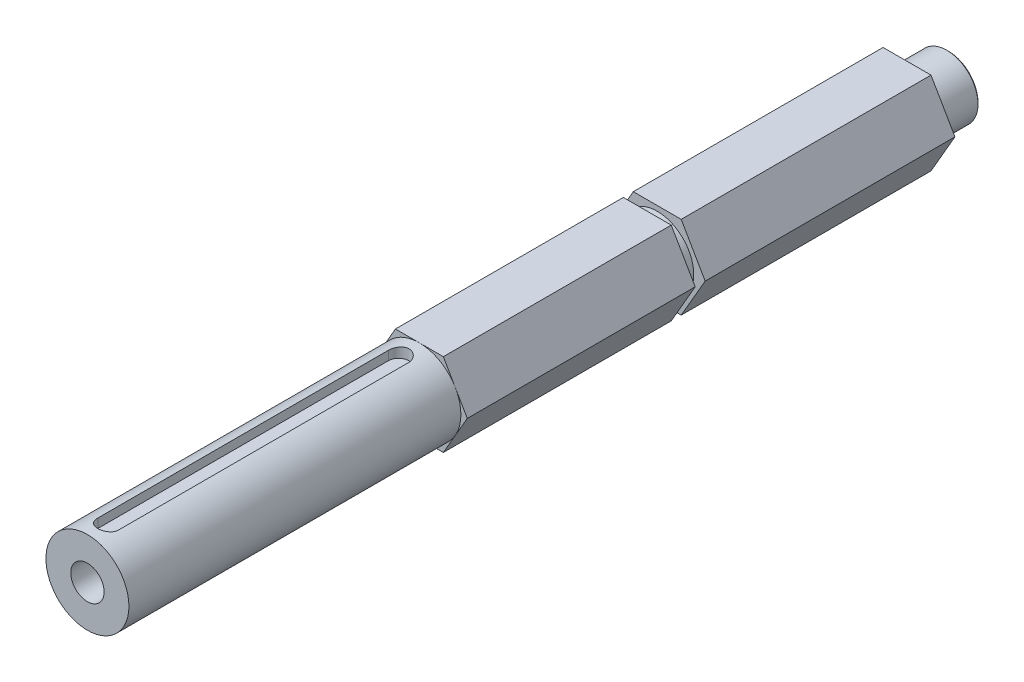
ISO-10303-21;
HEADER;
FILE_DESCRIPTION(('STEP AP214'),'2;1');
FILE_NAME('part.step','',(''),(''),'','','');
FILE_SCHEMA(('AUTOMOTIVE_DESIGN { 1 0 10303 214 1 1 1 1 }'));
ENDSEC;
DATA;
#1=APPLICATION_CONTEXT('core data for automotive mechanical design processes');
#2=APPLICATION_PROTOCOL_DEFINITION('international standard','automotive_design',2000,#1);
#3=PRODUCT_CONTEXT('',#1,'mechanical');
#4=PRODUCT('Part','Part','',(#3));
#5=PRODUCT_RELATED_PRODUCT_CATEGORY('part','',(#4));
#6=PRODUCT_DEFINITION_FORMATION('','',#4);
#7=PRODUCT_DEFINITION_CONTEXT('part definition',#1,'design');
#8=PRODUCT_DEFINITION('design','',#6,#7);
#9=PRODUCT_DEFINITION_SHAPE('','',#8);
#10=(LENGTH_UNIT() NAMED_UNIT(*) SI_UNIT(.MILLI.,.METRE.));
#11=(NAMED_UNIT(*) PLANE_ANGLE_UNIT() SI_UNIT($,.RADIAN.));
#12=(NAMED_UNIT(*) SI_UNIT($,.STERADIAN.) SOLID_ANGLE_UNIT());
#13=UNCERTAINTY_MEASURE_WITH_UNIT(LENGTH_MEASURE(1.E-05),#10,'distance_accuracy_value','');
#14=(GEOMETRIC_REPRESENTATION_CONTEXT(3) GLOBAL_UNCERTAINTY_ASSIGNED_CONTEXT((#13)) GLOBAL_UNIT_ASSIGNED_CONTEXT((#10,
#11,#12)) REPRESENTATION_CONTEXT('',''));
#15=CARTESIAN_POINT('',(0.,0.,0.));
#16=DIRECTION('',(0.,0.,1.));
#17=DIRECTION('',(1.,0.,0.));
#18=AXIS2_PLACEMENT_3D('',#15,#16,#17);
#19=CARTESIAN_POINT('',(0.,0.,11.176));
#20=DIRECTION('',(0.,0.,-1.));
#21=DIRECTION('',(-1.,0.,0.));
#22=AXIS2_PLACEMENT_3D('',#19,#20,#21);
#23=PLANE('',#22);
#24=CARTESIAN_POINT('',(0.,0.,11.176));
#25=DIRECTION('',(0.,0.,-1.));
#26=DIRECTION('',(-1.,0.,0.));
#27=AXIS2_PLACEMENT_3D('',#24,#25,#26);
#28=CIRCLE('',#27,3.175);
#29=CARTESIAN_POINT('',(-3.175,0.,11.176));
#30=VERTEX_POINT('',#29);
#31=EDGE_CURVE('E20',#30,#30,#28,.T.);
#32=ORIENTED_EDGE('',*,*,#31,.T.);
#33=EDGE_LOOP('',(#32));
#34=FACE_BOUND('',#33,.T.);
#35=ADVANCED_FACE('F17',(#34),#23,.T.);
#36=CARTESIAN_POINT('',(0.,0.,11.176));
#37=DIRECTION('',(0.,0.,-1.));
#38=DIRECTION('',(-1.,0.,0.));
#39=AXIS2_PLACEMENT_3D('',#36,#37,#38);
#40=CYLINDRICAL_SURFACE('',#39,3.175);
#41=CARTESIAN_POINT('',(0.,0.,0.254000000040833));
#42=DIRECTION('',(0.,0.,-1.));
#43=DIRECTION('',(-1.,0.,0.));
#44=AXIS2_PLACEMENT_3D('',#41,#42,#43);
#45=CIRCLE('',#44,3.17499999999882);
#46=CARTESIAN_POINT('',(-3.17499999999882,0.,0.254000000040833));
#47=VERTEX_POINT('',#46);
#48=EDGE_CURVE('E186',#47,#47,#45,.T.);
#49=ORIENTED_EDGE('',*,*,#48,.T.);
#50=EDGE_LOOP('',(#49));
#51=FACE_BOUND('',#50,.T.);
#52=ORIENTED_EDGE('',*,*,#31,.F.);
#53=EDGE_LOOP('',(#52));
#54=FACE_BOUND('',#53,.T.);
#55=ADVANCED_FACE('F436',(#51,#54),#40,.F.);
#56=CARTESIAN_POINT('',(0.,0.,5.6843418860808E-11));
#57=DIRECTION('',(0.,0.,-1.));
#58=DIRECTION('',(-1.,0.,0.));
#59=AXIS2_PLACEMENT_3D('',#56,#57,#58);
#60=CONICAL_SURFACE('',#59,3.42899999998281,0.785398163285552);
#61=CARTESIAN_POINT('',(0.,0.,0.));
#62=DIRECTION('',(0.,0.,-1.));
#63=DIRECTION('',(-1.,0.,0.));
#64=AXIS2_PLACEMENT_3D('',#61,#62,#63);
#65=CIRCLE('',#64,3.42900000003965);
#66=CARTESIAN_POINT('',(-3.42900000003965,0.,0.));
#67=VERTEX_POINT('',#66);
#68=EDGE_CURVE('E188',#67,#67,#65,.T.);
#69=ORIENTED_EDGE('',*,*,#68,.T.);
#70=EDGE_LOOP('',(#69));
#71=FACE_BOUND('',#70,.T.);
#72=ORIENTED_EDGE('',*,*,#48,.F.);
#73=EDGE_LOOP('',(#72));
#74=FACE_BOUND('',#73,.T.);
#75=ADVANCED_FACE('F433',(#71,#74),#60,.F.);
#76=CARTESIAN_POINT('',(0.,0.,0.));
#77=DIRECTION('',(0.,0.,1.));
#78=DIRECTION('',(1.,0.,0.));
#79=AXIS2_PLACEMENT_3D('',#76,#77,#78);
#80=PLANE('',#79);
#81=ORIENTED_EDGE('',*,*,#68,.F.);
#82=EDGE_LOOP('',(#81));
#83=FACE_BOUND('',#82,.T.);
#84=CARTESIAN_POINT('',(0.,0.,-5.6843418860808E-11));
#85=DIRECTION('',(0.,0.,1.));
#86=DIRECTION('',(1.,0.,0.));
#87=AXIS2_PLACEMENT_3D('',#84,#85,#86);
#88=CIRCLE('',#87,4.50850000004266);
#89=CARTESIAN_POINT('',(4.50850000004266,0.,-5.6843418860808E-11));
#90=VERTEX_POINT('',#89);
#91=EDGE_CURVE('E185',#90,#90,#88,.T.);
#92=ORIENTED_EDGE('',*,*,#91,.F.);
#93=EDGE_LOOP('',(#92));
#94=FACE_BOUND('',#93,.T.);
#95=ADVANCED_FACE('F429',(#83,#94),#80,.F.);
#96=CARTESIAN_POINT('',(0.,0.,0.253999999870302));
#97=DIRECTION('',(0.,0.,1.));
#98=DIRECTION('',(1.,0.,0.));
#99=AXIS2_PLACEMENT_3D('',#96,#97,#98);
#100=CONICAL_SURFACE('',#99,4.7624999999698,0.785398163397448);
#101=ORIENTED_EDGE('',*,*,#91,.T.);
#102=EDGE_LOOP('',(#101));
#103=FACE_BOUND('',#102,.T.);
#104=CARTESIAN_POINT('',(0.,0.,0.253999999999998));
#105=DIRECTION('',(0.,0.,-1.));
#106=DIRECTION('',(-1.,0.,0.));
#107=AXIS2_PLACEMENT_3D('',#104,#105,#106);
#108=CIRCLE('',#107,4.7625);
#109=CARTESIAN_POINT('',(-4.7625,0.,0.253999999999998));
#110=VERTEX_POINT('',#109);
#111=EDGE_CURVE('E182',#110,#110,#108,.F.);
#112=ORIENTED_EDGE('',*,*,#111,.F.);
#113=EDGE_LOOP('',(#112));
#114=FACE_BOUND('',#113,.T.);
#115=ADVANCED_FACE('F425',(#103,#114),#100,.T.);
#116=CARTESIAN_POINT('',(0.,0.,6.35));
#117=DIRECTION('',(0.,0.,-1.));
#118=DIRECTION('',(-1.,0.,0.));
#119=AXIS2_PLACEMENT_3D('',#116,#117,#118);
#120=CYLINDRICAL_SURFACE('',#119,4.7625);
#121=CARTESIAN_POINT('',(0.,0.,6.35));
#122=DIRECTION('',(0.,0.,-1.));
#123=DIRECTION('',(-1.,0.,0.));
#124=AXIS2_PLACEMENT_3D('',#121,#122,#123);
#125=CIRCLE('',#124,4.7625);
#126=CARTESIAN_POINT('',(-4.7625,0.,6.35));
#127=VERTEX_POINT('',#126);
#128=EDGE_CURVE('E167',#127,#127,#125,.T.);
#129=ORIENTED_EDGE('',*,*,#128,.T.);
#130=EDGE_LOOP('',(#129));
#131=FACE_BOUND('',#130,.T.);
#132=ORIENTED_EDGE('',*,*,#111,.T.);
#133=EDGE_LOOP('',(#132));
#134=FACE_BOUND('',#133,.T.);
#135=ADVANCED_FACE('F421',(#131,#134),#120,.T.);
#136=CARTESIAN_POINT('',(0.,0.,6.35));
#137=DIRECTION('',(0.,0.,1.));
#138=DIRECTION('',(1.,0.,0.));
#139=AXIS2_PLACEMENT_3D('',#136,#137,#138);
#140=PLANE('',#139);
#141=ORIENTED_EDGE('',*,*,#128,.F.);
#142=EDGE_LOOP('',(#141));
#143=FACE_BOUND('',#142,.T.);
#144=DIRECTION('',(-1.,0.,0.));
#145=VECTOR('',#144,1.);
#146=CARTESIAN_POINT('',(-3.66617420935412,-6.35,6.35));
#147=LINE('',#146,#145);
#148=CARTESIAN_POINT('',(3.66617420935412,-6.35,6.35));
#149=VERTEX_POINT('',#148);
#150=CARTESIAN_POINT('',(-3.66617420935412,-6.35,6.35));
#151=VERTEX_POINT('',#150);
#152=EDGE_CURVE('E374',#149,#151,#147,.T.);
#153=ORIENTED_EDGE('',*,*,#152,.T.);
#154=DIRECTION('',(-0.5,0.866025403784438,0.));
#155=VECTOR('',#154,1.);
#156=CARTESIAN_POINT('',(-7.33234841870825,0.,6.35));
#157=LINE('',#156,#155);
#158=CARTESIAN_POINT('',(-7.33234841870825,0.,6.35));
#159=VERTEX_POINT('',#158);
#160=EDGE_CURVE('E379',#151,#159,#157,.T.);
#161=ORIENTED_EDGE('',*,*,#160,.T.);
#162=DIRECTION('',(0.5,0.866025403784439,0.));
#163=VECTOR('',#162,1.);
#164=CARTESIAN_POINT('',(-3.66617420935412,6.35,6.35));
#165=LINE('',#164,#163);
#166=CARTESIAN_POINT('',(-3.66617420935412,6.35,6.35));
#167=VERTEX_POINT('',#166);
#168=EDGE_CURVE('E384',#159,#167,#165,.T.);
#169=ORIENTED_EDGE('',*,*,#168,.T.);
#170=DIRECTION('',(1.,0.,0.));
#171=VECTOR('',#170,1.);
#172=CARTESIAN_POINT('',(3.66617420935412,6.35,6.35));
#173=LINE('',#172,#171);
#174=CARTESIAN_POINT('',(3.66617420935412,6.35,6.35));
#175=VERTEX_POINT('',#174);
#176=EDGE_CURVE('E171',#167,#175,#173,.T.);
#177=ORIENTED_EDGE('',*,*,#176,.T.);
#178=DIRECTION('',(0.5,-0.866025403784439,0.));
#179=VECTOR('',#178,1.);
#180=CARTESIAN_POINT('',(7.33234841870825,0.,6.34999999999999));
#181=LINE('',#180,#179);
#182=CARTESIAN_POINT('',(7.33234841870825,0.,6.35));
#183=VERTEX_POINT('',#182);
#184=EDGE_CURVE('E153',#175,#183,#181,.T.);
#185=ORIENTED_EDGE('',*,*,#184,.T.);
#186=DIRECTION('',(-0.5,-0.866025403784439,0.));
#187=VECTOR('',#186,1.);
#188=CARTESIAN_POINT('',(3.66617420935412,-6.35,6.35));
#189=LINE('',#188,#187);
#190=EDGE_CURVE('E158',#183,#149,#189,.T.);
#191=ORIENTED_EDGE('',*,*,#190,.T.);
#192=EDGE_LOOP('',(#153,#161,#169,#177,#185,#191));
#193=FACE_BOUND('',#192,.T.);
#194=ADVANCED_FACE('F169',(#143,#193),#140,.F.);
#195=CARTESIAN_POINT('',(3.66617420935412,-6.35,44.577));
#196=DIRECTION('',(-0.866025403784439,0.5,0.));
#197=DIRECTION('',(-0.5,-0.866025403784439,0.));
#198=AXIS2_PLACEMENT_3D('',#195,#196,#197);
#199=PLANE('',#198);
#200=DIRECTION('',(0.,0.,1.));
#201=VECTOR('',#200,1.);
#202=CARTESIAN_POINT('',(7.33234841870825,0.,44.577));
#203=LINE('',#202,#201);
#204=CARTESIAN_POINT('',(7.33234841870825,0.,44.577));
#205=VERTEX_POINT('',#204);
#206=EDGE_CURVE('E160',#183,#205,#203,.T.);
#207=ORIENTED_EDGE('',*,*,#206,.T.);
#208=DIRECTION('',(0.5,0.866025403784439,0.));
#209=VECTOR('',#208,1.);
#210=CARTESIAN_POINT('',(3.66617420935412,-6.35,44.577));
#211=LINE('',#210,#209);
#212=CARTESIAN_POINT('',(3.66617420935412,-6.35,44.577));
#213=VERTEX_POINT('',#212);
#214=EDGE_CURVE('E372',#213,#205,#211,.T.);
#215=ORIENTED_EDGE('',*,*,#214,.F.);
#216=DIRECTION('',(0.,0.,1.));
#217=VECTOR('',#216,1.);
#218=CARTESIAN_POINT('',(3.66617420935412,-6.35,44.577));
#219=LINE('',#218,#217);
#220=EDGE_CURVE('E163',#213,#149,#219,.F.);
#221=ORIENTED_EDGE('',*,*,#220,.T.);
#222=ORIENTED_EDGE('',*,*,#190,.F.);
#223=EDGE_LOOP('',(#207,#215,#221,#222));
#224=FACE_BOUND('',#223,.T.);
#225=ADVANCED_FACE('F159',(#224),#199,.F.);
#226=CARTESIAN_POINT('',(7.33234841870825,0.,44.577));
#227=DIRECTION('',(-0.866025403784439,-0.5,0.));
#228=DIRECTION('',(0.5,-0.866025403784439,0.));
#229=AXIS2_PLACEMENT_3D('',#226,#227,#228);
#230=PLANE('',#229);
#231=DIRECTION('',(0.,0.,-1.));
#232=VECTOR('',#231,1.);
#233=CARTESIAN_POINT('',(3.66617420935412,6.35,44.577));
#234=LINE('',#233,#232);
#235=CARTESIAN_POINT('',(3.66617420935412,6.35,44.577));
#236=VERTEX_POINT('',#235);
#237=EDGE_CURVE('E173',#175,#236,#234,.F.);
#238=ORIENTED_EDGE('',*,*,#237,.T.);
#239=DIRECTION('',(-0.5,0.866025403784438,0.));
#240=VECTOR('',#239,1.);
#241=CARTESIAN_POINT('',(7.33234841870825,0.,44.577));
#242=LINE('',#241,#240);
#243=EDGE_CURVE('E177',#205,#236,#242,.T.);
#244=ORIENTED_EDGE('',*,*,#243,.F.);
#245=ORIENTED_EDGE('',*,*,#206,.F.);
#246=ORIENTED_EDGE('',*,*,#184,.F.);
#247=EDGE_LOOP('',(#238,#244,#245,#246));
#248=FACE_BOUND('',#247,.T.);
#249=ADVANCED_FACE('F175',(#248),#230,.F.);
#250=CARTESIAN_POINT('',(3.66617420935412,6.35,44.577));
#251=DIRECTION('',(0.,-1.,0.));
#252=DIRECTION('',(0.,0.,-1.));
#253=AXIS2_PLACEMENT_3D('',#250,#251,#252);
#254=PLANE('',#253);
#255=DIRECTION('',(0.,0.,1.));
#256=VECTOR('',#255,1.);
#257=CARTESIAN_POINT('',(-3.66617420935412,6.35,44.577));
#258=LINE('',#257,#256);
#259=CARTESIAN_POINT('',(-3.66617420935412,6.35,44.577));
#260=VERTEX_POINT('',#259);
#261=EDGE_CURVE('E386',#167,#260,#258,.T.);
#262=ORIENTED_EDGE('',*,*,#261,.T.);
#263=DIRECTION('',(1.,0.,0.));
#264=VECTOR('',#263,1.);
#265=CARTESIAN_POINT('',(0.,6.35,44.577));
#266=LINE('',#265,#264);
#267=EDGE_CURVE('E368',#236,#260,#266,.F.);
#268=ORIENTED_EDGE('',*,*,#267,.F.);
#269=ORIENTED_EDGE('',*,*,#237,.F.);
#270=ORIENTED_EDGE('',*,*,#176,.F.);
#271=EDGE_LOOP('',(#262,#268,#269,#270));
#272=FACE_BOUND('',#271,.T.);
#273=ADVANCED_FACE('F390',(#272),#254,.F.);
#274=CARTESIAN_POINT('',(-3.66617420935412,6.35,44.577));
#275=DIRECTION('',(0.866025403784439,-0.5,0.));
#276=DIRECTION('',(0.5,0.866025403784439,0.));
#277=AXIS2_PLACEMENT_3D('',#274,#275,#276);
#278=PLANE('',#277);
#279=DIRECTION('',(0.,0.,1.));
#280=VECTOR('',#279,1.);
#281=CARTESIAN_POINT('',(-7.33234841870825,0.,44.577));
#282=LINE('',#281,#280);
#283=CARTESIAN_POINT('',(-7.33234841870825,0.,44.577));
#284=VERTEX_POINT('',#283);
#285=EDGE_CURVE('E382',#159,#284,#282,.T.);
#286=ORIENTED_EDGE('',*,*,#285,.T.);
#287=DIRECTION('',(-0.5,-0.866025403784438,0.));
#288=VECTOR('',#287,1.);
#289=CARTESIAN_POINT('',(-3.66617420935412,6.35,44.577));
#290=LINE('',#289,#288);
#291=EDGE_CURVE('E365',#260,#284,#290,.T.);
#292=ORIENTED_EDGE('',*,*,#291,.F.);
#293=ORIENTED_EDGE('',*,*,#261,.F.);
#294=ORIENTED_EDGE('',*,*,#168,.F.);
#295=EDGE_LOOP('',(#286,#292,#293,#294));
#296=FACE_BOUND('',#295,.T.);
#297=ADVANCED_FACE('F404',(#296),#278,.F.);
#298=CARTESIAN_POINT('',(-7.33234841870825,0.,44.577));
#299=DIRECTION('',(0.866025403784438,0.5,0.));
#300=DIRECTION('',(-0.5,0.866025403784438,0.));
#301=AXIS2_PLACEMENT_3D('',#298,#299,#300);
#302=PLANE('',#301);
#303=DIRECTION('',(0.,0.,1.));
#304=VECTOR('',#303,1.);
#305=CARTESIAN_POINT('',(-3.66617420935412,-6.35,44.577));
#306=LINE('',#305,#304);
#307=CARTESIAN_POINT('',(-3.66617420935412,-6.35,44.577));
#308=VERTEX_POINT('',#307);
#309=EDGE_CURVE('E377',#151,#308,#306,.T.);
#310=ORIENTED_EDGE('',*,*,#309,.T.);
#311=DIRECTION('',(0.5,-0.866025403784438,0.));
#312=VECTOR('',#311,1.);
#313=CARTESIAN_POINT('',(-7.33234841870825,0.,44.577));
#314=LINE('',#313,#312);
#315=EDGE_CURVE('E362',#284,#308,#314,.T.);
#316=ORIENTED_EDGE('',*,*,#315,.F.);
#317=ORIENTED_EDGE('',*,*,#285,.F.);
#318=ORIENTED_EDGE('',*,*,#160,.F.);
#319=EDGE_LOOP('',(#310,#316,#317,#318));
#320=FACE_BOUND('',#319,.T.);
#321=ADVANCED_FACE('F402',(#320),#302,.F.);
#322=CARTESIAN_POINT('',(-3.66617420935412,-6.35,44.577));
#323=DIRECTION('',(0.,1.,0.));
#324=DIRECTION('',(-1.,0.,0.));
#325=AXIS2_PLACEMENT_3D('',#322,#323,#324);
#326=PLANE('',#325);
#327=ORIENTED_EDGE('',*,*,#220,.F.);
#328=DIRECTION('',(1.,0.,0.));
#329=VECTOR('',#328,1.);
#330=CARTESIAN_POINT('',(0.,-6.35,44.577));
#331=LINE('',#330,#329);
#332=EDGE_CURVE('E358',#308,#213,#331,.T.);
#333=ORIENTED_EDGE('',*,*,#332,.F.);
#334=ORIENTED_EDGE('',*,*,#309,.F.);
#335=ORIENTED_EDGE('',*,*,#152,.F.);
#336=EDGE_LOOP('',(#327,#333,#334,#335));
#337=FACE_BOUND('',#336,.T.);
#338=ADVANCED_FACE('F397',(#337),#326,.F.);
#339=CARTESIAN_POINT('',(0.,0.,44.577));
#340=DIRECTION('',(0.,0.,1.));
#341=DIRECTION('',(1.,0.,0.));
#342=AXIS2_PLACEMENT_3D('',#339,#340,#341);
#343=PLANE('',#342);
#344=CARTESIAN_POINT('',(0.,0.,44.577));
#345=DIRECTION('',(0.,0.,-1.));
#346=DIRECTION('',(-1.,0.,0.));
#347=AXIS2_PLACEMENT_3D('',#344,#345,#346);
#348=CIRCLE('',#347,5.588);
#349=CARTESIAN_POINT('',(-5.588,0.,44.577));
#350=VERTEX_POINT('',#349);
#351=EDGE_CURVE('E361',#350,#350,#348,.F.);
#352=ORIENTED_EDGE('',*,*,#351,.F.);
#353=EDGE_LOOP('',(#352));
#354=FACE_BOUND('',#353,.T.);
#355=ORIENTED_EDGE('',*,*,#315,.T.);
#356=ORIENTED_EDGE('',*,*,#332,.T.);
#357=ORIENTED_EDGE('',*,*,#214,.T.);
#358=ORIENTED_EDGE('',*,*,#243,.T.);
#359=ORIENTED_EDGE('',*,*,#267,.T.);
#360=ORIENTED_EDGE('',*,*,#291,.T.);
#361=EDGE_LOOP('',(#355,#356,#357,#358,#359,#360));
#362=FACE_BOUND('',#361,.T.);
#363=ADVANCED_FACE('F394',(#354,#362),#343,.T.);
#364=CARTESIAN_POINT('',(0.,0.,46.101));
#365=DIRECTION('',(0.,0.,-1.));
#366=DIRECTION('',(-1.,0.,0.));
#367=AXIS2_PLACEMENT_3D('',#364,#365,#366);
#368=CYLINDRICAL_SURFACE('',#367,5.588);
#369=CARTESIAN_POINT('',(0.,0.,46.101));
#370=DIRECTION('',(0.,0.,-1.));
#371=DIRECTION('',(-1.,0.,0.));
#372=AXIS2_PLACEMENT_3D('',#369,#370,#371);
#373=CIRCLE('',#372,5.588);
#374=CARTESIAN_POINT('',(-5.588,0.,46.101));
#375=VERTEX_POINT('',#374);
#376=EDGE_CURVE('E346',#375,#375,#373,.T.);
#377=ORIENTED_EDGE('',*,*,#376,.T.);
#378=EDGE_LOOP('',(#377));
#379=FACE_BOUND('',#378,.T.);
#380=ORIENTED_EDGE('',*,*,#351,.T.);
#381=EDGE_LOOP('',(#380));
#382=FACE_BOUND('',#381,.T.);
#383=ADVANCED_FACE('F539',(#379,#382),#368,.T.);
#384=CARTESIAN_POINT('',(0.,0.,46.101));
#385=DIRECTION('',(0.,0.,1.));
#386=DIRECTION('',(1.,0.,0.));
#387=AXIS2_PLACEMENT_3D('',#384,#385,#386);
#388=PLANE('',#387);
#389=ORIENTED_EDGE('',*,*,#376,.F.);
#390=EDGE_LOOP('',(#389));
#391=FACE_BOUND('',#390,.T.);
#392=DIRECTION('',(-1.,0.,0.));
#393=VECTOR('',#392,1.);
#394=CARTESIAN_POINT('',(-3.66617420935412,-6.35,46.101));
#395=LINE('',#394,#393);
#396=CARTESIAN_POINT('',(3.66617420935413,-6.35,46.101));
#397=VERTEX_POINT('',#396);
#398=CARTESIAN_POINT('',(-3.66617420935412,-6.35,46.101));
#399=VERTEX_POINT('',#398);
#400=EDGE_CURVE('E315',#397,#399,#395,.T.);
#401=ORIENTED_EDGE('',*,*,#400,.T.);
#402=DIRECTION('',(-0.5,0.866025403784438,0.));
#403=VECTOR('',#402,1.);
#404=CARTESIAN_POINT('',(-7.33234841870824,0.,46.101));
#405=LINE('',#404,#403);
#406=CARTESIAN_POINT('',(-7.33234841870824,0.,46.101));
#407=VERTEX_POINT('',#406);
#408=EDGE_CURVE('E320',#399,#407,#405,.T.);
#409=ORIENTED_EDGE('',*,*,#408,.T.);
#410=DIRECTION('',(0.499999999999999,0.866025403784439,0.));
#411=VECTOR('',#410,1.);
#412=CARTESIAN_POINT('',(-3.66617420935413,6.35,46.101));
#413=LINE('',#412,#411);
#414=CARTESIAN_POINT('',(-3.66617420935413,6.35,46.101));
#415=VERTEX_POINT('',#414);
#416=EDGE_CURVE('E330',#407,#415,#413,.T.);
#417=ORIENTED_EDGE('',*,*,#416,.T.);
#418=DIRECTION('',(1.,0.,0.));
#419=VECTOR('',#418,1.);
#420=CARTESIAN_POINT('',(3.66617420935412,6.35,46.101));
#421=LINE('',#420,#419);
#422=CARTESIAN_POINT('',(3.66617420935412,6.35,46.101));
#423=VERTEX_POINT('',#422);
#424=EDGE_CURVE('E344',#415,#423,#421,.T.);
#425=ORIENTED_EDGE('',*,*,#424,.T.);
#426=DIRECTION('',(0.5,-0.866025403784439,0.));
#427=VECTOR('',#426,1.);
#428=CARTESIAN_POINT('',(7.33234841870824,0.,46.101));
#429=LINE('',#428,#427);
#430=CARTESIAN_POINT('',(7.33234841870824,0.,46.101));
#431=VERTEX_POINT('',#430);
#432=EDGE_CURVE('E89',#423,#431,#429,.T.);
#433=ORIENTED_EDGE('',*,*,#432,.T.);
#434=DIRECTION('',(-0.499999999999999,-0.866025403784439,0.));
#435=VECTOR('',#434,1.);
#436=CARTESIAN_POINT('',(3.66617420935413,-6.35,46.101));
#437=LINE('',#436,#435);
#438=EDGE_CURVE('E310',#431,#397,#437,.T.);
#439=ORIENTED_EDGE('',*,*,#438,.T.);
#440=EDGE_LOOP('',(#401,#409,#417,#425,#433,#439));
#441=FACE_BOUND('',#440,.T.);
#442=ADVANCED_FACE('F549',(#391,#441),#388,.F.);
#443=CARTESIAN_POINT('',(0.,4.7625,84.15274));
#444=DIRECTION('',(0.,1.,0.));
#445=DIRECTION('',(-1.,0.,0.));
#446=AXIS2_PLACEMENT_3D('',#443,#444,#445);
#447=PLANE('',#446);
#448=CARTESIAN_POINT('',(0.,4.7625,128.60274));
#449=DIRECTION('',(0.,1.,0.));
#450=DIRECTION('',(-1.,0.,0.));
#451=AXIS2_PLACEMENT_3D('',#448,#449,#450);
#452=CIRCLE('',#451,1.5875);
#453=CARTESIAN_POINT('',(-1.58749999999999,4.7625,128.60274));
#454=VERTEX_POINT('',#453);
#455=CARTESIAN_POINT('',(1.5875,4.7625,128.60274));
#456=VERTEX_POINT('',#455);
#457=EDGE_CURVE('E303',#454,#456,#452,.T.);
#458=ORIENTED_EDGE('',*,*,#457,.T.);
#459=DIRECTION('',(0.,0.,1.));
#460=VECTOR('',#459,1.);
#461=CARTESIAN_POINT('',(1.5875,4.7625,84.15274));
#462=LINE('',#461,#460);
#463=CARTESIAN_POINT('',(1.5875,4.7625,84.15274));
#464=VERTEX_POINT('',#463);
#465=EDGE_CURVE('E280',#456,#464,#462,.F.);
#466=ORIENTED_EDGE('',*,*,#465,.T.);
#467=CARTESIAN_POINT('',(0.,4.7625,84.15274));
#468=DIRECTION('',(0.,1.,0.));
#469=DIRECTION('',(-1.,0.,0.));
#470=AXIS2_PLACEMENT_3D('',#467,#468,#469);
#471=CIRCLE('',#470,1.5875);
#472=CARTESIAN_POINT('',(-1.5875,4.7625,84.15274));
#473=VERTEX_POINT('',#472);
#474=EDGE_CURVE('E298',#464,#473,#471,.T.);
#475=ORIENTED_EDGE('',*,*,#474,.T.);
#476=DIRECTION('',(0.,0.,1.));
#477=VECTOR('',#476,1.);
#478=CARTESIAN_POINT('',(-1.5875,4.7625,84.15274));
#479=LINE('',#478,#477);
#480=EDGE_CURVE('E80',#473,#454,#479,.T.);
#481=ORIENTED_EDGE('',*,*,#480,.T.);
#482=EDGE_LOOP('',(#458,#466,#475,#481));
#483=FACE_BOUND('',#482,.T.);
#484=ADVANCED_FACE('F559',(#483),#447,.T.);
#485=CARTESIAN_POINT('',(3.66617420935412,6.35,131.77774));
#486=DIRECTION('',(0.,-1.,0.));
#487=DIRECTION('',(1.,0.,0.));
#488=AXIS2_PLACEMENT_3D('',#485,#486,#487);
#489=PLANE('',#488);
#490=DIRECTION('',(0.,0.,1.));
#491=VECTOR('',#490,1.);
#492=CARTESIAN_POINT('',(3.66617420935412,6.35,131.77774));
#493=LINE('',#492,#491);
#494=CARTESIAN_POINT('',(3.66617420935412,6.35,80.97774));
#495=VERTEX_POINT('',#494);
#496=EDGE_CURVE('E309',#495,#423,#493,.F.);
#497=ORIENTED_EDGE('',*,*,#496,.T.);
#498=ORIENTED_EDGE('',*,*,#424,.F.);
#499=DIRECTION('',(0.,0.,1.));
#500=VECTOR('',#499,1.);
#501=CARTESIAN_POINT('',(-3.66617420935413,6.35,131.77774));
#502=LINE('',#501,#500);
#503=CARTESIAN_POINT('',(-3.66617420935413,6.35,80.97774));
#504=VERTEX_POINT('',#503);
#505=EDGE_CURVE('E328',#415,#504,#502,.T.);
#506=ORIENTED_EDGE('',*,*,#505,.T.);
#507=DIRECTION('',(1.,0.,0.));
#508=VECTOR('',#507,1.);
#509=CARTESIAN_POINT('',(0.,6.35,80.97774));
#510=LINE('',#509,#508);
#511=CARTESIAN_POINT('',(0.,6.35,80.97774));
#512=VERTEX_POINT('',#511);
#513=EDGE_CURVE('E814',#512,#504,#510,.F.);
#514=ORIENTED_EDGE('',*,*,#513,.F.);
#515=DIRECTION('',(1.,0.,0.));
#516=VECTOR('',#515,1.);
#517=CARTESIAN_POINT('',(0.,6.35,80.97774));
#518=LINE('',#517,#516);
#519=EDGE_CURVE('E287',#495,#512,#518,.F.);
#520=ORIENTED_EDGE('',*,*,#519,.F.);
#521=EDGE_LOOP('',(#497,#498,#506,#514,#520));
#522=FACE_BOUND('',#521,.T.);
#523=ADVANCED_FACE('F569',(#522),#489,.F.);
#524=CARTESIAN_POINT('',(0.,0.,115.267739999922));
#525=DIRECTION('',(0.,0.,1.));
#526=DIRECTION('',(1.,0.,0.));
#527=AXIS2_PLACEMENT_3D('',#524,#525,#526);
#528=CONICAL_SURFACE('',#527,2.55269999991015,1.02974425853382);
#529=CARTESIAN_POINT('',(-1.70530256582424E-10,0.,113.733923097698));
#530=VERTEX_POINT('',#529);
#531=VERTEX_LOOP('',#530);
#532=FACE_BOUND('',#531,.T.);
#533=CARTESIAN_POINT('',(0.,0.,115.26774));
#534=DIRECTION('',(0.,0.,1.));
#535=DIRECTION('',(1.,0.,0.));
#536=AXIS2_PLACEMENT_3D('',#533,#534,#535);
#537=CIRCLE('',#536,2.55269999999999);
#538=CARTESIAN_POINT('',(2.55269999999999,0.,115.26774));
#539=VERTEX_POINT('',#538);
#540=EDGE_CURVE('E323',#539,#539,#537,.T.);
#541=ORIENTED_EDGE('',*,*,#540,.T.);
#542=EDGE_LOOP('',(#541));
#543=FACE_BOUND('',#542,.T.);
#544=ADVANCED_FACE('F578',(#532,#543),#528,.F.);
#545=CARTESIAN_POINT('',(-3.66617420935413,6.35,131.77774));
#546=DIRECTION('',(0.866025403784439,-0.499999999999999,0.));
#547=DIRECTION('',(0.499999999999999,0.866025403784439,0.));
#548=AXIS2_PLACEMENT_3D('',#545,#546,#547);
#549=PLANE('',#548);
#550=ORIENTED_EDGE('',*,*,#505,.F.);
#551=ORIENTED_EDGE('',*,*,#416,.F.);
#552=DIRECTION('',(0.,0.,1.));
#553=VECTOR('',#552,1.);
#554=CARTESIAN_POINT('',(-7.33234841870824,0.,131.77774));
#555=LINE('',#554,#553);
#556=CARTESIAN_POINT('',(-7.33234841870825,0.,80.97774));
#557=VERTEX_POINT('',#556);
#558=EDGE_CURVE('E318',#407,#557,#555,.T.);
#559=ORIENTED_EDGE('',*,*,#558,.T.);
#560=DIRECTION('',(-0.500000000000001,-0.866025403784438,0.));
#561=VECTOR('',#560,1.);
#562=CARTESIAN_POINT('',(-5.49926131403119,3.175,80.97774));
#563=LINE('',#562,#561);
#564=CARTESIAN_POINT('',(-5.49926131403119,3.175,80.97774));
#565=VERTEX_POINT('',#564);
#566=EDGE_CURVE('E326',#565,#557,#563,.T.);
#567=ORIENTED_EDGE('',*,*,#566,.F.);
#568=DIRECTION('',(-0.5,-0.866025403784438,0.));
#569=VECTOR('',#568,1.);
#570=CARTESIAN_POINT('',(-3.66617420935413,6.35000000000001,80.97774));
#571=LINE('',#570,#569);
#572=EDGE_CURVE('E327',#504,#565,#571,.T.);
#573=ORIENTED_EDGE('',*,*,#572,.F.);
#574=EDGE_LOOP('',(#550,#551,#559,#567,#573));
#575=FACE_BOUND('',#574,.T.);
#576=ADVANCED_FACE('F588',(#575),#549,.F.);
#577=CARTESIAN_POINT('',(-7.33234841870824,0.,131.77774));
#578=DIRECTION('',(0.866025403784438,0.5,0.));
#579=DIRECTION('',(-0.5,0.866025403784438,0.));
#580=AXIS2_PLACEMENT_3D('',#577,#578,#579);
#581=PLANE('',#580);
#582=ORIENTED_EDGE('',*,*,#558,.F.);
#583=ORIENTED_EDGE('',*,*,#408,.F.);
#584=DIRECTION('',(0.,0.,1.));
#585=VECTOR('',#584,1.);
#586=CARTESIAN_POINT('',(-3.66617420935412,-6.35,131.77774));
#587=LINE('',#586,#585);
#588=CARTESIAN_POINT('',(-3.66617420935413,-6.35,80.97774));
#589=VERTEX_POINT('',#588);
#590=EDGE_CURVE('E313',#399,#589,#587,.T.);
#591=ORIENTED_EDGE('',*,*,#590,.T.);
#592=DIRECTION('',(0.5,-0.866025403784438,0.));
#593=VECTOR('',#592,1.);
#594=CARTESIAN_POINT('',(-5.49926131403119,-3.175,80.97774));
#595=LINE('',#594,#593);
#596=CARTESIAN_POINT('',(-5.49926131403119,-3.175,80.97774));
#597=VERTEX_POINT('',#596);
#598=EDGE_CURVE('E795',#597,#589,#595,.T.);
#599=ORIENTED_EDGE('',*,*,#598,.F.);
#600=DIRECTION('',(0.499999999999999,-0.866025403784439,0.));
#601=VECTOR('',#600,1.);
#602=CARTESIAN_POINT('',(-7.33234841870825,0.,80.97774));
#603=LINE('',#602,#601);
#604=EDGE_CURVE('E798',#557,#597,#603,.T.);
#605=ORIENTED_EDGE('',*,*,#604,.F.);
#606=EDGE_LOOP('',(#582,#583,#591,#599,#605));
#607=FACE_BOUND('',#606,.T.);
#608=ADVANCED_FACE('F598',(#607),#581,.F.);
#609=CARTESIAN_POINT('',(-3.66617420935412,-6.35,131.77774));
#610=DIRECTION('',(0.,1.,0.));
#611=DIRECTION('',(-1.,0.,0.));
#612=AXIS2_PLACEMENT_3D('',#609,#610,#611);
#613=PLANE('',#612);
#614=ORIENTED_EDGE('',*,*,#590,.F.);
#615=ORIENTED_EDGE('',*,*,#400,.F.);
#616=DIRECTION('',(0.,0.,1.));
#617=VECTOR('',#616,1.);
#618=CARTESIAN_POINT('',(3.66617420935413,-6.35,131.77774));
#619=LINE('',#618,#617);
#620=CARTESIAN_POINT('',(3.66617420935412,-6.35,80.97774));
#621=VERTEX_POINT('',#620);
#622=EDGE_CURVE('E306',#397,#621,#619,.T.);
#623=ORIENTED_EDGE('',*,*,#622,.T.);
#624=DIRECTION('',(1.,0.,0.));
#625=VECTOR('',#624,1.);
#626=CARTESIAN_POINT('',(0.,-6.35,80.97774));
#627=LINE('',#626,#625);
#628=CARTESIAN_POINT('',(0.,-6.35,80.97774));
#629=VERTEX_POINT('',#628);
#630=EDGE_CURVE('E791',#629,#621,#627,.T.);
#631=ORIENTED_EDGE('',*,*,#630,.F.);
#632=DIRECTION('',(1.,0.,0.));
#633=VECTOR('',#632,1.);
#634=CARTESIAN_POINT('',(0.,-6.35,80.97774));
#635=LINE('',#634,#633);
#636=EDGE_CURVE('E788',#589,#629,#635,.T.);
#637=ORIENTED_EDGE('',*,*,#636,.F.);
#638=EDGE_LOOP('',(#614,#615,#623,#631,#637));
#639=FACE_BOUND('',#638,.T.);
#640=ADVANCED_FACE('F608',(#639),#613,.F.);
#641=CARTESIAN_POINT('',(3.66617420935413,-6.35,131.77774));
#642=DIRECTION('',(-0.866025403784439,0.499999999999999,0.));
#643=DIRECTION('',(-0.499999999999999,-0.866025403784439,0.));
#644=AXIS2_PLACEMENT_3D('',#641,#642,#643);
#645=PLANE('',#644);
#646=ORIENTED_EDGE('',*,*,#622,.F.);
#647=ORIENTED_EDGE('',*,*,#438,.F.);
#648=DIRECTION('',(0.,0.,1.));
#649=VECTOR('',#648,1.);
#650=CARTESIAN_POINT('',(7.33234841870824,0.,131.77774));
#651=LINE('',#650,#649);
#652=CARTESIAN_POINT('',(7.33234841870824,0.,80.97774));
#653=VERTEX_POINT('',#652);
#654=EDGE_CURVE('E301',#431,#653,#651,.T.);
#655=ORIENTED_EDGE('',*,*,#654,.T.);
#656=DIRECTION('',(0.499999999999999,0.866025403784439,0.));
#657=VECTOR('',#656,1.);
#658=CARTESIAN_POINT('',(5.49926131403119,-3.175,80.97774));
#659=LINE('',#658,#657);
#660=CARTESIAN_POINT('',(5.49926131403118,-3.175,80.97774));
#661=VERTEX_POINT('',#660);
#662=EDGE_CURVE('E35',#661,#653,#659,.T.);
#663=ORIENTED_EDGE('',*,*,#662,.F.);
#664=DIRECTION('',(0.5,0.866025403784439,0.));
#665=VECTOR('',#664,1.);
#666=CARTESIAN_POINT('',(3.66617420935412,-6.35,80.97774));
#667=LINE('',#666,#665);
#668=EDGE_CURVE('E794',#621,#661,#667,.T.);
#669=ORIENTED_EDGE('',*,*,#668,.F.);
#670=EDGE_LOOP('',(#646,#647,#655,#663,#669));
#671=FACE_BOUND('',#670,.T.);
#672=ADVANCED_FACE('F618',(#671),#645,.F.);
#673=CARTESIAN_POINT('',(7.33234841870824,0.,131.77774));
#674=DIRECTION('',(-0.866025403784439,-0.5,0.));
#675=DIRECTION('',(0.5,-0.866025403784439,0.));
#676=AXIS2_PLACEMENT_3D('',#673,#674,#675);
#677=PLANE('',#676);
#678=ORIENTED_EDGE('',*,*,#654,.F.);
#679=ORIENTED_EDGE('',*,*,#432,.F.);
#680=ORIENTED_EDGE('',*,*,#496,.F.);
#681=DIRECTION('',(-0.5,0.866025403784438,0.));
#682=VECTOR('',#681,1.);
#683=CARTESIAN_POINT('',(5.49926131403118,3.175,80.97774));
#684=LINE('',#683,#682);
#685=CARTESIAN_POINT('',(5.49926131403118,3.175,80.97774));
#686=VERTEX_POINT('',#685);
#687=EDGE_CURVE('E284',#686,#495,#684,.T.);
#688=ORIENTED_EDGE('',*,*,#687,.F.);
#689=DIRECTION('',(-0.5,0.866025403784438,0.));
#690=VECTOR('',#689,1.);
#691=CARTESIAN_POINT('',(7.33234841870824,0.,80.97774));
#692=LINE('',#691,#690);
#693=EDGE_CURVE('E835',#653,#686,#692,.T.);
#694=ORIENTED_EDGE('',*,*,#693,.F.);
#695=EDGE_LOOP('',(#678,#679,#680,#688,#694));
#696=FACE_BOUND('',#695,.T.);
#697=ADVANCED_FACE('F628',(#696),#677,.F.);
#698=CARTESIAN_POINT('',(0.,4.7625,128.60274));
#699=DIRECTION('',(0.,1.,0.));
#700=DIRECTION('',(-1.,0.,0.));
#701=AXIS2_PLACEMENT_3D('',#698,#699,#700);
#702=CYLINDRICAL_SURFACE('',#701,1.5875);
#703=CARTESIAN_POINT('',(1.5875,6.14836106210428,128.60274));
#704=CARTESIAN_POINT('',(1.58750053577508,6.14835810871031,128.646654988857));
#705=CARTESIAN_POINT('',(1.5856766092084,6.14883215794785,128.690548217541));
#706=CARTESIAN_POINT('',(1.57840568144076,6.15070373829612,128.778006406044));
#707=CARTESIAN_POINT('',(1.57295928989663,6.15210111401178,128.821571419853));
#708=CARTESIAN_POINT('',(1.55126569251976,6.15762216168135,128.951121912469));
#709=CARTESIAN_POINT('',(1.52966371608634,6.16307509998734,129.036217143716));
#710=CARTESIAN_POINT('',(1.4728794460437,6.17688983358454,129.201425419629));
#711=CARTESIAN_POINT('',(1.43769842861035,6.18525135551601,129.281538931663));
#712=CARTESIAN_POINT('',(1.35479691261607,6.20393625974203,129.434766924728));
#713=CARTESIAN_POINT('',(1.30707305157913,6.2142601679059,129.507879521777));
#714=CARTESIAN_POINT('',(1.19933159902707,6.23595816556865,129.646590912526));
#715=CARTESIAN_POINT('',(1.13909041419458,6.24734893258404,129.712013381915));
#716=CARTESIAN_POINT('',(1.00850030156954,6.26975353228957,129.831944567054));
#717=CARTESIAN_POINT('',(0.938149761172664,6.28076730449528,129.88645153828));
#718=CARTESIAN_POINT('',(0.788125327800202,6.30136189374656,129.98372371507));
#719=CARTESIAN_POINT('',(0.708335102780997,6.31092058682247,130.026314584875));
#720=CARTESIAN_POINT('',(0.542452862963151,6.3273359967281,130.097410515537));
#721=CARTESIAN_POINT('',(0.456362092231792,6.33419324527088,130.125918348576));
#722=CARTESIAN_POINT('',(0.282168772283704,6.34431516258141,130.167473651034));
#723=CARTESIAN_POINT('',(0.194142236179552,6.34764975230815,130.180822429971));
#724=CARTESIAN_POINT('',(0.017038281394685,6.3505943306442,130.192626602325));
#725=CARTESIAN_POINT('',(-0.072039003795551,6.35020478739593,130.19108386768));
#726=CARTESIAN_POINT('',(-0.246622082593182,6.34579689318106,130.173364932649));
#727=CARTESIAN_POINT('',(-0.332163264011998,6.34185927900311,130.157514296148));
#728=CARTESIAN_POINT('',(-0.499330203846367,6.33089174885438,130.112152971797));
#729=CARTESIAN_POINT('',(-0.580955788848058,6.32386169606571,130.08264167956));
#730=CARTESIAN_POINT('',(-0.738834066563933,6.30737558946855,130.010532966935));
#731=CARTESIAN_POINT('',(-0.815031436993547,6.29789815201245,129.967819511655));
#732=CARTESIAN_POINT('',(-0.959289152077626,6.27754563547797,129.870607781389));
#733=CARTESIAN_POINT('',(-1.02734826845511,6.26667034593953,129.816107730973));
#734=CARTESIAN_POINT('',(-1.15533390616221,6.244360860613,129.695132227071));
#735=CARTESIAN_POINT('',(-1.21499170109842,6.23291950133326,129.628373526993));
#736=CARTESIAN_POINT('',(-1.32233920060814,6.21103292150861,129.485660086252));
#737=CARTESIAN_POINT('',(-1.37002562901402,6.20058797413253,129.409702836662));
#738=CARTESIAN_POINT('',(-1.45225247599145,6.18184904068292,129.250208863455));
#739=CARTESIAN_POINT('',(-1.48672076589602,6.17356693289505,129.166633549477));
#740=CARTESIAN_POINT('',(-1.54098998356159,6.160247058562,128.994666876136));
#741=CARTESIAN_POINT('',(-1.56081283787425,6.15520444346279,128.90628292995));
#742=CARTESIAN_POINT('',(-1.5778236083021,6.1508527395692,128.781401408045));
#743=CARTESIAN_POINT('',(-1.58145288065964,6.1499198043849,128.745742471149));
#744=CARTESIAN_POINT('',(-1.58628835284461,6.14867424201248,128.674308008519));
#745=CARTESIAN_POINT('',(-1.58749847297747,6.14836061123395,128.638532765671));
#746=CARTESIAN_POINT('',(-1.58749999999999,6.14836106210428,128.60274));
#747=B_SPLINE_CURVE_WITH_KNOTS('',3,(#703,#704,#705,#706,#707,#708,#709,#710,#711,#712,#713,
#714,#715,#716,#717,#718,#719,#720,#721,#722,#723,#724,#725,#726,#727,#728,#729,#730,#731,#732,
#733,#734,#735,#736,#737,#738,#739,#740,#741,#742,#743,#744,#745,#746),.UNSPECIFIED.,.F.,.F.,(4,
2,2,2,2,2,2,2,2,2,2,2,2,2,2,2,2,2,2,2,2,4),(0.,0.131661741914362,0.263301330909383,
0.525827566389991,0.788329135320231,1.0509011473787,1.31864401216689,1.58642963374344,
1.85794947018445,2.12941583787722,2.39538639405576,2.66132351682412,2.92135790948347,
3.1814038079289,3.44380358752469,3.70624292030868,3.97575769386084,4.24534614449783,
4.5163854325569,4.78701810469724,4.89451409847198,5.00183575024027),.UNSPECIFIED.);
#748=CARTESIAN_POINT('',(1.5875,6.14836106210428,128.60274));
#749=VERTEX_POINT('',#748);
#750=CARTESIAN_POINT('',(-1.58749999999999,6.14836106210428,128.60274));
#751=VERTEX_POINT('',#750);
#752=EDGE_CURVE('E219',#749,#751,#747,.T.);
#753=ORIENTED_EDGE('',*,*,#752,.F.);
#754=DIRECTION('',(0.,1.,0.));
#755=VECTOR('',#754,1.);
#756=CARTESIAN_POINT('',(1.5875,4.7625,128.60274));
#757=LINE('',#756,#755);
#758=EDGE_CURVE('E289',#749,#456,#757,.F.);
#759=ORIENTED_EDGE('',*,*,#758,.T.);
#760=ORIENTED_EDGE('',*,*,#457,.F.);
#761=DIRECTION('',(0.,-1.,0.));
#762=VECTOR('',#761,1.);
#763=CARTESIAN_POINT('',(-1.58749999999999,4.7625,128.60274));
#764=LINE('',#763,#762);
#765=EDGE_CURVE('E299',#454,#751,#764,.F.);
#766=ORIENTED_EDGE('',*,*,#765,.T.);
#767=EDGE_LOOP('',(#753,#759,#760,#766));
#768=FACE_BOUND('',#767,.T.);
#769=ADVANCED_FACE('F637',(#768),#702,.F.);
#770=CARTESIAN_POINT('',(-1.5875,4.7625,84.15274));
#771=DIRECTION('',(-1.,0.,0.));
#772=DIRECTION('',(0.,-1.,0.));
#773=AXIS2_PLACEMENT_3D('',#770,#771,#772);
#774=PLANE('',#773);
#775=ORIENTED_EDGE('',*,*,#765,.F.);
#776=ORIENTED_EDGE('',*,*,#480,.F.);
#777=DIRECTION('',(0.,1.,0.));
#778=VECTOR('',#777,1.);
#779=CARTESIAN_POINT('',(-1.5875,4.7625,84.15274));
#780=LINE('',#779,#778);
#781=CARTESIAN_POINT('',(-1.5875,6.14836106210428,84.15274));
#782=VERTEX_POINT('',#781);
#783=EDGE_CURVE('E296',#473,#782,#780,.T.);
#784=ORIENTED_EDGE('',*,*,#783,.T.);
#785=DIRECTION('',(0.,0.,1.));
#786=VECTOR('',#785,1.);
#787=CARTESIAN_POINT('',(-1.58749999999999,6.14836106210428,80.97774));
#788=LINE('',#787,#786);
#789=EDGE_CURVE('E218',#751,#782,#788,.F.);
#790=ORIENTED_EDGE('',*,*,#789,.F.);
#791=EDGE_LOOP('',(#775,#776,#784,#790));
#792=FACE_BOUND('',#791,.T.);
#793=ADVANCED_FACE('F273',(#792),#774,.F.);
#794=CARTESIAN_POINT('',(0.,4.7625,84.15274));
#795=DIRECTION('',(0.,1.,0.));
#796=DIRECTION('',(-1.,0.,0.));
#797=AXIS2_PLACEMENT_3D('',#794,#795,#796);
#798=CYLINDRICAL_SURFACE('',#797,1.5875);
#799=CARTESIAN_POINT('',(-1.5875,6.14836106210428,84.15274));
#800=CARTESIAN_POINT('',(-1.58750053577508,6.14835810871032,84.1088250111434));
#801=CARTESIAN_POINT('',(-1.58567660920839,6.14883215794785,84.0649317824586));
#802=CARTESIAN_POINT('',(-1.57840568144076,6.15070373829613,83.9774735939556));
#803=CARTESIAN_POINT('',(-1.57295928989663,6.15210111401178,83.9339085801467));
#804=CARTESIAN_POINT('',(-1.55126569251976,6.15762216168136,83.8043580875309));
#805=CARTESIAN_POINT('',(-1.52966371608633,6.16307509998735,83.7192628562845));
#806=CARTESIAN_POINT('',(-1.47287944604369,6.17688983358455,83.5540545803711));
#807=CARTESIAN_POINT('',(-1.43769842861034,6.18525135551602,83.4739410683371));
#808=CARTESIAN_POINT('',(-1.35479691261606,6.20393625974204,83.3207130752724));
#809=CARTESIAN_POINT('',(-1.30707305157913,6.2142601679059,83.2476004782231));
#810=CARTESIAN_POINT('',(-1.19933159902705,6.23595816556865,83.1088890874741));
#811=CARTESIAN_POINT('',(-1.13909041419455,6.24734893258404,83.0434666180852));
#812=CARTESIAN_POINT('',(-1.0085003015695,6.26975353228958,82.9235354329462));
#813=CARTESIAN_POINT('',(-0.938149761172632,6.28076730449528,82.8690284617196));
#814=CARTESIAN_POINT('',(-0.788125327800174,6.30136189374657,82.7717562849304));
#815=CARTESIAN_POINT('',(-0.708335102780969,6.31092058682247,82.7291654151254));
#816=CARTESIAN_POINT('',(-0.542452862963127,6.3273359967281,82.6580694844627));
#817=CARTESIAN_POINT('',(-0.45636209223177,6.33419324527088,82.629561651424));
#818=CARTESIAN_POINT('',(-0.282168772283683,6.34431516258141,82.5880063489658));
#819=CARTESIAN_POINT('',(-0.194142236179529,6.34764975230815,82.5746575700288));
#820=CARTESIAN_POINT('',(-0.0170382813946614,6.3505943306442,82.562853397675));
#821=CARTESIAN_POINT('',(0.072039003795574,6.35020478739593,82.5643961323197));
#822=CARTESIAN_POINT('',(0.246622082593205,6.34579689318106,82.5821150673507));
#823=CARTESIAN_POINT('',(0.332163264012022,6.3418592790031,82.5979657038517));
#824=CARTESIAN_POINT('',(0.499330203846392,6.33089174885437,82.6433270282026));
#825=CARTESIAN_POINT('',(0.580955788848083,6.3238616960657,82.6728383204401));
#826=CARTESIAN_POINT('',(0.738834066563961,6.30737558946855,82.7449470330647));
#827=CARTESIAN_POINT('',(0.815031436993577,6.29789815201245,82.7876604883446));
#828=CARTESIAN_POINT('',(0.959289152077656,6.27754563547797,82.8848722186106));
#829=CARTESIAN_POINT('',(1.02734826845514,6.26667034593952,82.939372269027));
#830=CARTESIAN_POINT('',(1.15533390616224,6.24436086061299,83.0603477729291));
#831=CARTESIAN_POINT('',(1.21499170109844,6.23291950133326,83.127106473007));
#832=CARTESIAN_POINT('',(1.32233920060816,6.2110329215086,83.2698199137478));
#833=CARTESIAN_POINT('',(1.37002562901404,6.20058797413252,83.3457771633377));
#834=CARTESIAN_POINT('',(1.45225247599147,6.18184904068291,83.5052711365452));
#835=CARTESIAN_POINT('',(1.48672076589604,6.17356693289505,83.5888464505225));
#836=CARTESIAN_POINT('',(1.54098998356161,6.160247058562,83.760813123864));
#837=CARTESIAN_POINT('',(1.56081283787426,6.15520444346279,83.8491970700504));
#838=CARTESIAN_POINT('',(1.57782360830211,6.1508527395692,83.9740785919548));
#839=CARTESIAN_POINT('',(1.58145288065965,6.1499198043849,84.0097375288509));
#840=CARTESIAN_POINT('',(1.58628835284461,6.14867424201247,84.0811719914811));
#841=CARTESIAN_POINT('',(1.58749847297747,6.14836061123394,84.116947234329));
#842=CARTESIAN_POINT('',(1.5875,6.14836106210428,84.15274));
#843=B_SPLINE_CURVE_WITH_KNOTS('',3,(#799,#800,#801,#802,#803,#804,#805,#806,#807,#808,#809,
#810,#811,#812,#813,#814,#815,#816,#817,#818,#819,#820,#821,#822,#823,#824,#825,#826,#827,#828,
#829,#830,#831,#832,#833,#834,#835,#836,#837,#838,#839,#840,#841,#842),.UNSPECIFIED.,.F.,.F.,(4,
2,2,2,2,2,2,2,2,2,2,2,2,2,2,2,2,2,2,2,2,4),(0.,0.131661741914404,0.263301330909397,
0.525827566390006,0.788329135320261,1.05090114737873,1.31864401216692,1.58642963374349,
1.85794947018449,2.12941583787725,2.39538639405579,2.66132351682414,2.9213579094835,
3.18140380792893,3.44380358752474,3.70624292030873,3.97575769386088,4.24534614449787,
4.51638543255696,4.78701810469728,4.89451409847204,5.00183575024028),.UNSPECIFIED.);
#844=CARTESIAN_POINT('',(1.5875,6.14836106210428,84.15274));
#845=VERTEX_POINT('',#844);
#846=EDGE_CURVE('E210',#782,#845,#843,.T.);
#847=ORIENTED_EDGE('',*,*,#846,.F.);
#848=ORIENTED_EDGE('',*,*,#783,.F.);
#849=ORIENTED_EDGE('',*,*,#474,.F.);
#850=DIRECTION('',(0.,1.,0.));
#851=VECTOR('',#850,1.);
#852=CARTESIAN_POINT('',(1.5875,4.7625,84.15274));
#853=LINE('',#852,#851);
#854=EDGE_CURVE('E278',#464,#845,#853,.T.);
#855=ORIENTED_EDGE('',*,*,#854,.T.);
#856=EDGE_LOOP('',(#847,#848,#849,#855));
#857=FACE_BOUND('',#856,.T.);
#858=ADVANCED_FACE('F225',(#857),#798,.F.);
#859=CARTESIAN_POINT('',(1.5875,4.7625,84.15274));
#860=DIRECTION('',(1.,0.,0.));
#861=DIRECTION('',(0.,1.,0.));
#862=AXIS2_PLACEMENT_3D('',#859,#860,#861);
#863=PLANE('',#862);
#864=ORIENTED_EDGE('',*,*,#854,.F.);
#865=ORIENTED_EDGE('',*,*,#465,.F.);
#866=ORIENTED_EDGE('',*,*,#758,.F.);
#867=DIRECTION('',(0.,0.,1.));
#868=VECTOR('',#867,1.);
#869=CARTESIAN_POINT('',(1.5875,6.14836106210428,80.97774));
#870=LINE('',#869,#868);
#871=EDGE_CURVE('E209',#845,#749,#870,.T.);
#872=ORIENTED_EDGE('',*,*,#871,.F.);
#873=EDGE_LOOP('',(#864,#865,#866,#872));
#874=FACE_BOUND('',#873,.T.);
#875=ADVANCED_FACE('F265',(#874),#863,.F.);
#876=CARTESIAN_POINT('',(0.,0.,80.97774));
#877=DIRECTION('',(0.,0.,1.));
#878=DIRECTION('',(1.,0.,0.));
#879=AXIS2_PLACEMENT_3D('',#876,#877,#878);
#880=PLANE('',#879);
#881=ORIENTED_EDGE('',*,*,#519,.T.);
#882=CARTESIAN_POINT('',(0.,0.,80.97774));
#883=DIRECTION('',(0.,0.,1.));
#884=DIRECTION('',(1.,0.,0.));
#885=AXIS2_PLACEMENT_3D('',#882,#883,#884);
#886=CIRCLE('',#885,6.35);
#887=EDGE_CURVE('E206',#686,#512,#886,.T.);
#888=ORIENTED_EDGE('',*,*,#887,.F.);
#889=ORIENTED_EDGE('',*,*,#687,.T.);
#890=EDGE_LOOP('',(#881,#888,#889));
#891=FACE_BOUND('',#890,.T.);
#892=ADVANCED_FACE('F262',(#891),#880,.T.);
#893=CARTESIAN_POINT('',(0.,0.,80.97774));
#894=DIRECTION('',(0.,0.,1.));
#895=DIRECTION('',(1.,0.,0.));
#896=AXIS2_PLACEMENT_3D('',#893,#894,#895);
#897=PLANE('',#896);
#898=ORIENTED_EDGE('',*,*,#572,.T.);
#899=CARTESIAN_POINT('',(0.,0.,80.97774));
#900=DIRECTION('',(0.,0.,1.));
#901=DIRECTION('',(1.,0.,0.));
#902=AXIS2_PLACEMENT_3D('',#899,#900,#901);
#903=CIRCLE('',#902,6.35);
#904=EDGE_CURVE('E203',#512,#565,#903,.T.);
#905=ORIENTED_EDGE('',*,*,#904,.F.);
#906=ORIENTED_EDGE('',*,*,#513,.T.);
#907=EDGE_LOOP('',(#898,#905,#906));
#908=FACE_BOUND('',#907,.T.);
#909=ADVANCED_FACE('F258',(#908),#897,.T.);
#910=CARTESIAN_POINT('',(0.,0.,131.77774));
#911=DIRECTION('',(0.,0.,1.));
#912=DIRECTION('',(1.,0.,0.));
#913=AXIS2_PLACEMENT_3D('',#910,#911,#912);
#914=CYLINDRICAL_SURFACE('',#913,2.55269999999999);
#915=CARTESIAN_POINT('',(0.,0.,131.77774));
#916=DIRECTION('',(0.,0.,1.));
#917=DIRECTION('',(1.,0.,0.));
#918=AXIS2_PLACEMENT_3D('',#915,#916,#917);
#919=CIRCLE('',#918,2.55269999999999);
#920=CARTESIAN_POINT('',(2.55269999999999,0.,131.77774));
#921=VERTEX_POINT('',#920);
#922=EDGE_CURVE('E200',#921,#921,#919,.F.);
#923=ORIENTED_EDGE('',*,*,#922,.F.);
#924=EDGE_LOOP('',(#923));
#925=FACE_BOUND('',#924,.T.);
#926=ORIENTED_EDGE('',*,*,#540,.F.);
#927=EDGE_LOOP('',(#926));
#928=FACE_BOUND('',#927,.T.);
#929=ADVANCED_FACE('F254',(#925,#928),#914,.F.);
#930=CARTESIAN_POINT('',(0.,0.,80.97774));
#931=DIRECTION('',(0.,0.,1.));
#932=DIRECTION('',(1.,0.,0.));
#933=AXIS2_PLACEMENT_3D('',#930,#931,#932);
#934=PLANE('',#933);
#935=CARTESIAN_POINT('',(0.,0.,80.97774));
#936=DIRECTION('',(0.,0.,1.));
#937=DIRECTION('',(1.,0.,0.));
#938=AXIS2_PLACEMENT_3D('',#935,#936,#937);
#939=CIRCLE('',#938,6.35);
#940=EDGE_CURVE('E197',#565,#597,#939,.T.);
#941=ORIENTED_EDGE('',*,*,#940,.F.);
#942=ORIENTED_EDGE('',*,*,#566,.T.);
#943=ORIENTED_EDGE('',*,*,#604,.T.);
#944=EDGE_LOOP('',(#941,#942,#943));
#945=FACE_BOUND('',#944,.T.);
#946=ADVANCED_FACE('F250',(#945),#934,.T.);
#947=CARTESIAN_POINT('',(0.,0.,80.97774));
#948=DIRECTION('',(0.,0.,1.));
#949=DIRECTION('',(1.,0.,0.));
#950=AXIS2_PLACEMENT_3D('',#947,#948,#949);
#951=PLANE('',#950);
#952=ORIENTED_EDGE('',*,*,#636,.T.);
#953=CARTESIAN_POINT('',(0.,0.,80.97774));
#954=DIRECTION('',(0.,0.,1.));
#955=DIRECTION('',(1.,0.,0.));
#956=AXIS2_PLACEMENT_3D('',#953,#954,#955);
#957=CIRCLE('',#956,6.35);
#958=EDGE_CURVE('E194',#597,#629,#957,.T.);
#959=ORIENTED_EDGE('',*,*,#958,.F.);
#960=ORIENTED_EDGE('',*,*,#598,.T.);
#961=EDGE_LOOP('',(#952,#959,#960));
#962=FACE_BOUND('',#961,.T.);
#963=ADVANCED_FACE('F246',(#962),#951,.T.);
#964=CARTESIAN_POINT('',(0.,0.,80.97774));
#965=DIRECTION('',(0.,0.,1.));
#966=DIRECTION('',(1.,0.,0.));
#967=AXIS2_PLACEMENT_3D('',#964,#965,#966);
#968=PLANE('',#967);
#969=CARTESIAN_POINT('',(0.,0.,80.97774));
#970=DIRECTION('',(0.,0.,1.));
#971=DIRECTION('',(1.,0.,0.));
#972=AXIS2_PLACEMENT_3D('',#969,#970,#971);
#973=CIRCLE('',#972,6.35);
#974=EDGE_CURVE('E191',#629,#661,#973,.T.);
#975=ORIENTED_EDGE('',*,*,#974,.F.);
#976=ORIENTED_EDGE('',*,*,#630,.T.);
#977=ORIENTED_EDGE('',*,*,#668,.T.);
#978=EDGE_LOOP('',(#975,#976,#977));
#979=FACE_BOUND('',#978,.T.);
#980=ADVANCED_FACE('F242',(#979),#968,.T.);
#981=CARTESIAN_POINT('',(0.,0.,80.97774));
#982=DIRECTION('',(0.,0.,1.));
#983=DIRECTION('',(1.,0.,0.));
#984=AXIS2_PLACEMENT_3D('',#981,#982,#983);
#985=PLANE('',#984);
#986=ORIENTED_EDGE('',*,*,#693,.T.);
#987=CARTESIAN_POINT('',(0.,0.,80.97774));
#988=DIRECTION('',(0.,0.,1.));
#989=DIRECTION('',(1.,0.,0.));
#990=AXIS2_PLACEMENT_3D('',#987,#988,#989);
#991=CIRCLE('',#990,6.35);
#992=EDGE_CURVE('E26',#661,#686,#991,.T.);
#993=ORIENTED_EDGE('',*,*,#992,.F.);
#994=ORIENTED_EDGE('',*,*,#662,.T.);
#995=EDGE_LOOP('',(#986,#993,#994));
#996=FACE_BOUND('',#995,.T.);
#997=ADVANCED_FACE('F238',(#996),#985,.T.);
#998=CARTESIAN_POINT('',(0.,0.,131.77774));
#999=DIRECTION('',(0.,0.,1.));
#1000=DIRECTION('',(1.,0.,0.));
#1001=AXIS2_PLACEMENT_3D('',#998,#999,#1000);
#1002=PLANE('',#1001);
#1003=CARTESIAN_POINT('',(0.,0.,131.77774));
#1004=DIRECTION('',(0.,0.,1.));
#1005=DIRECTION('',(1.,0.,0.));
#1006=AXIS2_PLACEMENT_3D('',#1003,#1004,#1005);
#1007=CIRCLE('',#1006,6.35);
#1008=CARTESIAN_POINT('',(6.35,0.,131.77774));
#1009=VERTEX_POINT('',#1008);
#1010=EDGE_CURVE('E11',#1009,#1009,#1007,.F.);
#1011=ORIENTED_EDGE('',*,*,#1010,.F.);
#1012=EDGE_LOOP('',(#1011));
#1013=FACE_BOUND('',#1012,.T.);
#1014=ORIENTED_EDGE('',*,*,#922,.T.);
#1015=EDGE_LOOP('',(#1014));
#1016=FACE_BOUND('',#1015,.T.);
#1017=ADVANCED_FACE('F233',(#1013,#1016),#1002,.T.);
#1018=CARTESIAN_POINT('',(0.,0.,80.97774));
#1019=DIRECTION('',(0.,0.,1.));
#1020=DIRECTION('',(1.,0.,0.));
#1021=AXIS2_PLACEMENT_3D('',#1018,#1019,#1020);
#1022=CYLINDRICAL_SURFACE('',#1021,6.35);
#1023=ORIENTED_EDGE('',*,*,#904,.T.);
#1024=ORIENTED_EDGE('',*,*,#940,.T.);
#1025=ORIENTED_EDGE('',*,*,#958,.T.);
#1026=ORIENTED_EDGE('',*,*,#974,.T.);
#1027=ORIENTED_EDGE('',*,*,#992,.T.);
#1028=ORIENTED_EDGE('',*,*,#887,.T.);
#1029=EDGE_LOOP('',(#1023,#1024,#1025,#1026,#1027,#1028));
#1030=FACE_BOUND('',#1029,.T.);
#1031=ORIENTED_EDGE('',*,*,#1010,.T.);
#1032=EDGE_LOOP('',(#1031));
#1033=FACE_BOUND('',#1032,.T.);
#1034=ORIENTED_EDGE('',*,*,#846,.T.);
#1035=ORIENTED_EDGE('',*,*,#871,.T.);
#1036=ORIENTED_EDGE('',*,*,#752,.T.);
#1037=ORIENTED_EDGE('',*,*,#789,.T.);
#1038=EDGE_LOOP('',(#1034,#1035,#1036,#1037));
#1039=FACE_BOUND('',#1038,.T.);
#1040=ADVANCED_FACE('F229',(#1030,#1033,#1039),#1022,.T.);
#1041=CLOSED_SHELL('',(#35,#55,#75,#95,#115,#135,#194,#225,#249,#273,#297,#321,#338,#363,#383,
#442,#484,#523,#544,#576,#608,#640,#672,#697,#769,#793,#858,#875,#892,#909,#929,#946,#963,#980,
#997,#1017,#1040));
#1042=MANIFOLD_SOLID_BREP('B1',#1041);
#1043=ADVANCED_BREP_SHAPE_REPRESENTATION('',(#18,#1042),#14);
#1044=SHAPE_DEFINITION_REPRESENTATION(#9,#1043);
ENDSEC;
END-ISO-10303-21;
